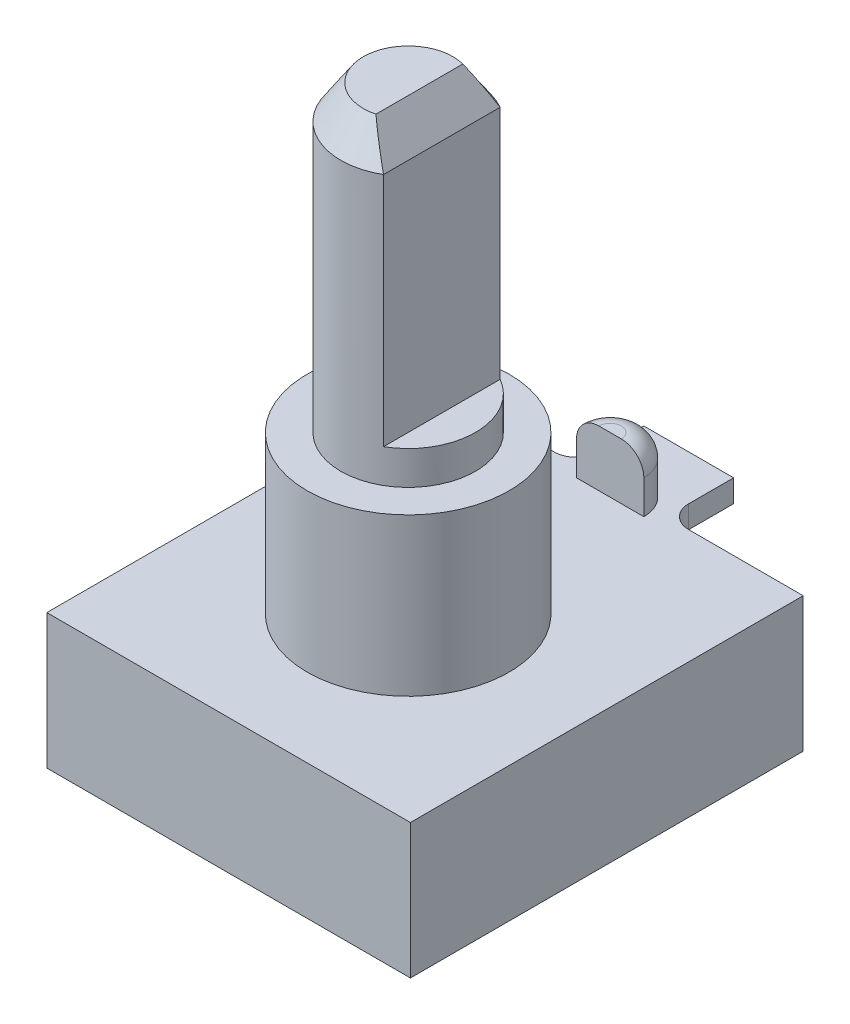
ISO-10303-21;
HEADER;
FILE_DESCRIPTION(('STEP AP214'),'2;1');
FILE_NAME('part.step','',(''),(''),'','','');
FILE_SCHEMA(('AUTOMOTIVE_DESIGN { 1 0 10303 214 1 1 1 1 }'));
ENDSEC;
DATA;
#1=APPLICATION_CONTEXT('core data for automotive mechanical design processes');
#2=APPLICATION_PROTOCOL_DEFINITION('international standard','automotive_design',2000,#1);
#3=PRODUCT_CONTEXT('',#1,'mechanical');
#4=PRODUCT('Part','Part','',(#3));
#5=PRODUCT_RELATED_PRODUCT_CATEGORY('part','',(#4));
#6=PRODUCT_DEFINITION_FORMATION('','',#4);
#7=PRODUCT_DEFINITION_CONTEXT('part definition',#1,'design');
#8=PRODUCT_DEFINITION('design','',#6,#7);
#9=PRODUCT_DEFINITION_SHAPE('','',#8);
#10=(LENGTH_UNIT() NAMED_UNIT(*) SI_UNIT(.MILLI.,.METRE.));
#11=(NAMED_UNIT(*) PLANE_ANGLE_UNIT() SI_UNIT($,.RADIAN.));
#12=(NAMED_UNIT(*) SI_UNIT($,.STERADIAN.) SOLID_ANGLE_UNIT());
#13=UNCERTAINTY_MEASURE_WITH_UNIT(LENGTH_MEASURE(1.E-05),#10,'distance_accuracy_value','');
#14=(GEOMETRIC_REPRESENTATION_CONTEXT(3) GLOBAL_UNCERTAINTY_ASSIGNED_CONTEXT((#13)) GLOBAL_UNIT_ASSIGNED_CONTEXT((#10,
#11,#12)) REPRESENTATION_CONTEXT('',''));
#15=CARTESIAN_POINT('',(0.,0.,0.));
#16=DIRECTION('',(0.,0.,1.));
#17=DIRECTION('',(1.,0.,0.));
#18=AXIS2_PLACEMENT_3D('',#15,#16,#17);
#19=CARTESIAN_POINT('',(0.,6.,0.));
#20=DIRECTION('',(0.,1.,0.));
#21=DIRECTION('',(0.,0.,1.));
#22=AXIS2_PLACEMENT_3D('',#19,#20,#21);
#23=PLANE('',#22);
#24=CARTESIAN_POINT('',(0.,6.,0.750000000000002));
#25=DIRECTION('',(0.,1.,0.));
#26=DIRECTION('',(0.,0.,1.));
#27=AXIS2_PLACEMENT_3D('',#24,#25,#26);
#28=CIRCLE('',#27,4.5);
#29=CARTESIAN_POINT('',(0.,6.,5.25));
#30=VERTEX_POINT('',#29);
#31=EDGE_CURVE('E226',#30,#30,#28,.T.);
#32=ORIENTED_EDGE('',*,*,#31,.F.);
#33=EDGE_LOOP('',(#32));
#34=FACE_BOUND('',#33,.T.);
#35=DIRECTION('',(0.,0.,-1.));
#36=VECTOR('',#35,1.);
#37=CARTESIAN_POINT('',(8.1,6.,-8.75));
#38=LINE('',#37,#36);
#39=CARTESIAN_POINT('',(8.1,6.,8.75));
#40=VERTEX_POINT('',#39);
#41=CARTESIAN_POINT('',(8.1,6.,-8.75));
#42=VERTEX_POINT('',#41);
#43=EDGE_CURVE('E266',#40,#42,#38,.T.);
#44=ORIENTED_EDGE('',*,*,#43,.T.);
#45=DIRECTION('',(-1.,0.,0.));
#46=VECTOR('',#45,1.);
#47=CARTESIAN_POINT('',(-8.1,6.,-8.75));
#48=LINE('',#47,#46);
#49=CARTESIAN_POINT('',(3.,6.,-8.75));
#50=VERTEX_POINT('',#49);
#51=EDGE_CURVE('E271',#42,#50,#48,.T.);
#52=ORIENTED_EDGE('',*,*,#51,.T.);
#53=CARTESIAN_POINT('',(3.,6.,-9.75));
#54=DIRECTION('',(0.,1.,0.));
#55=DIRECTION('',(0.,0.,1.));
#56=AXIS2_PLACEMENT_3D('',#53,#54,#55);
#57=CIRCLE('',#56,1.);
#58=CARTESIAN_POINT('',(2.,6.,-9.75));
#59=VERTEX_POINT('',#58);
#60=EDGE_CURVE('E309',#50,#59,#57,.F.);
#61=ORIENTED_EDGE('',*,*,#60,.T.);
#62=DIRECTION('',(0.,0.,1.));
#63=VECTOR('',#62,1.);
#64=CARTESIAN_POINT('',(2.,6.,-11.75));
#65=LINE('',#64,#63);
#66=CARTESIAN_POINT('',(2.,6.,-11.75));
#67=VERTEX_POINT('',#66);
#68=EDGE_CURVE('E204',#67,#59,#65,.T.);
#69=ORIENTED_EDGE('',*,*,#68,.F.);
#70=DIRECTION('',(1.,0.,0.));
#71=VECTOR('',#70,1.);
#72=CARTESIAN_POINT('',(2.,6.,-11.75));
#73=LINE('',#72,#71);
#74=CARTESIAN_POINT('',(-2.,6.,-11.75));
#75=VERTEX_POINT('',#74);
#76=EDGE_CURVE('E191',#75,#67,#73,.T.);
#77=ORIENTED_EDGE('',*,*,#76,.F.);
#78=DIRECTION('',(0.,0.,1.));
#79=VECTOR('',#78,1.);
#80=CARTESIAN_POINT('',(-2.,6.,-11.75));
#81=LINE('',#80,#79);
#82=CARTESIAN_POINT('',(-2.,6.,-9.75));
#83=VERTEX_POINT('',#82);
#84=EDGE_CURVE('E207',#75,#83,#81,.T.);
#85=ORIENTED_EDGE('',*,*,#84,.T.);
#86=CARTESIAN_POINT('',(-3.,6.,-9.75));
#87=DIRECTION('',(0.,1.,0.));
#88=DIRECTION('',(0.,0.,1.));
#89=AXIS2_PLACEMENT_3D('',#86,#87,#88);
#90=CIRCLE('',#89,1.);
#91=CARTESIAN_POINT('',(-3.,6.,-8.75));
#92=VERTEX_POINT('',#91);
#93=EDGE_CURVE('E311',#83,#92,#90,.F.);
#94=ORIENTED_EDGE('',*,*,#93,.T.);
#95=CARTESIAN_POINT('',(-8.1,6.,-8.75));
#96=VERTEX_POINT('',#95);
#97=EDGE_CURVE('E269',#92,#96,#48,.T.);
#98=ORIENTED_EDGE('',*,*,#97,.T.);
#99=DIRECTION('',(0.,0.,1.));
#100=VECTOR('',#99,1.);
#101=CARTESIAN_POINT('',(-8.1,6.,-8.75));
#102=LINE('',#101,#100);
#103=CARTESIAN_POINT('',(-8.1,6.,8.75));
#104=VERTEX_POINT('',#103);
#105=EDGE_CURVE('E274',#96,#104,#102,.T.);
#106=ORIENTED_EDGE('',*,*,#105,.T.);
#107=DIRECTION('',(1.,0.,0.));
#108=VECTOR('',#107,1.);
#109=CARTESIAN_POINT('',(-8.1,6.,8.75));
#110=LINE('',#109,#108);
#111=EDGE_CURVE('E276',#104,#40,#110,.T.);
#112=ORIENTED_EDGE('',*,*,#111,.T.);
#113=EDGE_LOOP('',(#44,#52,#61,#69,#77,#85,#94,#98,#106,#112));
#114=FACE_BOUND('',#113,.T.);
#115=DIRECTION('',(1.,0.,0.));
#116=VECTOR('',#115,1.);
#117=CARTESIAN_POINT('',(-1.5,6.,-8.25));
#118=LINE('',#117,#116);
#119=CARTESIAN_POINT('',(-1.5,6.,-8.25));
#120=VERTEX_POINT('',#119);
#121=CARTESIAN_POINT('',(1.5,6.,-8.25));
#122=VERTEX_POINT('',#121);
#123=EDGE_CURVE('E179',#120,#122,#118,.T.);
#124=ORIENTED_EDGE('',*,*,#123,.F.);
#125=CARTESIAN_POINT('',(0.,6.,-8.25));
#126=DIRECTION('',(0.,1.,0.));
#127=DIRECTION('',(0.,0.,1.));
#128=AXIS2_PLACEMENT_3D('',#125,#126,#127);
#129=CIRCLE('',#128,1.5);
#130=EDGE_CURVE('E173',#122,#120,#129,.T.);
#131=ORIENTED_EDGE('',*,*,#130,.F.);
#132=EDGE_LOOP('',(#124,#131));
#133=FACE_BOUND('',#132,.T.);
#134=ADVANCED_FACE('F37',(#34,#114,#133),#23,.T.);
#135=CARTESIAN_POINT('',(-8.1,6.,-8.75));
#136=DIRECTION('',(0.,0.,1.));
#137=DIRECTION('',(1.,0.,0.));
#138=AXIS2_PLACEMENT_3D('',#135,#136,#137);
#139=PLANE('',#138);
#140=DIRECTION('',(-1.,0.,0.));
#141=VECTOR('',#140,1.);
#142=CARTESIAN_POINT('',(2.,5.,-8.75));
#143=LINE('',#142,#141);
#144=CARTESIAN_POINT('',(3.,5.,-8.75));
#145=VERTEX_POINT('',#144);
#146=CARTESIAN_POINT('',(-3.,5.,-8.75));
#147=VERTEX_POINT('',#146);
#148=EDGE_CURVE('E187',#145,#147,#143,.T.);
#149=ORIENTED_EDGE('',*,*,#148,.F.);
#150=DIRECTION('',(0.,-1.,0.));
#151=VECTOR('',#150,1.);
#152=CARTESIAN_POINT('',(3.,6.,-8.75));
#153=LINE('',#152,#151);
#154=EDGE_CURVE('E301',#145,#50,#153,.F.);
#155=ORIENTED_EDGE('',*,*,#154,.T.);
#156=ORIENTED_EDGE('',*,*,#51,.F.);
#157=DIRECTION('',(0.,-1.,0.));
#158=VECTOR('',#157,1.);
#159=CARTESIAN_POINT('',(8.1,6.,-8.75));
#160=LINE('',#159,#158);
#161=CARTESIAN_POINT('',(8.1,0.,-8.75));
#162=VERTEX_POINT('',#161);
#163=EDGE_CURVE('E232',#42,#162,#160,.T.);
#164=ORIENTED_EDGE('',*,*,#163,.T.);
#165=DIRECTION('',(-1.,0.,0.));
#166=VECTOR('',#165,1.);
#167=CARTESIAN_POINT('',(-8.1,0.,-8.75));
#168=LINE('',#167,#166);
#169=CARTESIAN_POINT('',(-8.1,0.,-8.75));
#170=VERTEX_POINT('',#169);
#171=EDGE_CURVE('E281',#162,#170,#168,.T.);
#172=ORIENTED_EDGE('',*,*,#171,.T.);
#173=DIRECTION('',(0.,-1.,0.));
#174=VECTOR('',#173,1.);
#175=CARTESIAN_POINT('',(-8.1,6.,-8.75));
#176=LINE('',#175,#174);
#177=EDGE_CURVE('E291',#96,#170,#176,.T.);
#178=ORIENTED_EDGE('',*,*,#177,.F.);
#179=ORIENTED_EDGE('',*,*,#97,.F.);
#180=DIRECTION('',(0.,1.,0.));
#181=VECTOR('',#180,1.);
#182=CARTESIAN_POINT('',(-3.,5.,-8.75));
#183=LINE('',#182,#181);
#184=EDGE_CURVE('E298',#92,#147,#183,.F.);
#185=ORIENTED_EDGE('',*,*,#184,.T.);
#186=EDGE_LOOP('',(#149,#155,#156,#164,#172,#178,#179,#185));
#187=FACE_BOUND('',#186,.T.);
#188=ADVANCED_FACE('F358',(#187),#139,.F.);
#189=CARTESIAN_POINT('',(0.,0.,0.));
#190=DIRECTION('',(0.,1.,0.));
#191=DIRECTION('',(0.,0.,1.));
#192=AXIS2_PLACEMENT_3D('',#189,#190,#191);
#193=PLANE('',#192);
#194=DIRECTION('',(0.,0.,-1.));
#195=VECTOR('',#194,1.);
#196=CARTESIAN_POINT('',(8.1,0.,-8.75));
#197=LINE('',#196,#195);
#198=CARTESIAN_POINT('',(8.1,0.,8.75));
#199=VERTEX_POINT('',#198);
#200=EDGE_CURVE('E265',#199,#162,#197,.T.);
#201=ORIENTED_EDGE('',*,*,#200,.F.);
#202=DIRECTION('',(1.,0.,0.));
#203=VECTOR('',#202,1.);
#204=CARTESIAN_POINT('',(-8.1,0.,8.75));
#205=LINE('',#204,#203);
#206=CARTESIAN_POINT('',(-8.1,0.,8.75));
#207=VERTEX_POINT('',#206);
#208=EDGE_CURVE('E270',#207,#199,#205,.T.);
#209=ORIENTED_EDGE('',*,*,#208,.F.);
#210=DIRECTION('',(0.,0.,1.));
#211=VECTOR('',#210,1.);
#212=CARTESIAN_POINT('',(-8.1,0.,-8.75));
#213=LINE('',#212,#211);
#214=EDGE_CURVE('E283',#170,#207,#213,.T.);
#215=ORIENTED_EDGE('',*,*,#214,.F.);
#216=ORIENTED_EDGE('',*,*,#171,.F.);
#217=EDGE_LOOP('',(#201,#209,#215,#216));
#218=FACE_BOUND('',#217,.T.);
#219=DIRECTION('',(0.,0.,1.));
#220=VECTOR('',#219,1.);
#221=CARTESIAN_POINT('',(6.,0.,-6.));
#222=LINE('',#221,#220);
#223=CARTESIAN_POINT('',(6.,0.,-6.));
#224=VERTEX_POINT('',#223);
#225=CARTESIAN_POINT('',(6.,0.,6.));
#226=VERTEX_POINT('',#225);
#227=EDGE_CURVE('E229',#224,#226,#222,.T.);
#228=ORIENTED_EDGE('',*,*,#227,.F.);
#229=DIRECTION('',(1.,0.,0.));
#230=VECTOR('',#229,1.);
#231=CARTESIAN_POINT('',(-6.,0.,-6.));
#232=LINE('',#231,#230);
#233=CARTESIAN_POINT('',(-6.,0.,-6.));
#234=VERTEX_POINT('',#233);
#235=EDGE_CURVE('E237',#234,#224,#232,.T.);
#236=ORIENTED_EDGE('',*,*,#235,.F.);
#237=DIRECTION('',(0.,0.,-1.));
#238=VECTOR('',#237,1.);
#239=CARTESIAN_POINT('',(-6.,0.,-6.));
#240=LINE('',#239,#238);
#241=CARTESIAN_POINT('',(-6.,0.,6.));
#242=VERTEX_POINT('',#241);
#243=EDGE_CURVE('E249',#242,#234,#240,.T.);
#244=ORIENTED_EDGE('',*,*,#243,.F.);
#245=DIRECTION('',(-1.,0.,0.));
#246=VECTOR('',#245,1.);
#247=CARTESIAN_POINT('',(-6.,0.,6.));
#248=LINE('',#247,#246);
#249=EDGE_CURVE('E246',#226,#242,#248,.T.);
#250=ORIENTED_EDGE('',*,*,#249,.F.);
#251=EDGE_LOOP('',(#228,#236,#244,#250));
#252=FACE_BOUND('',#251,.T.);
#253=ADVANCED_FACE('F364',(#218,#252),#193,.F.);
#254=CARTESIAN_POINT('',(8.1,6.,-8.75));
#255=DIRECTION('',(-1.,0.,0.));
#256=DIRECTION('',(0.,0.,1.));
#257=AXIS2_PLACEMENT_3D('',#254,#255,#256);
#258=PLANE('',#257);
#259=ORIENTED_EDGE('',*,*,#200,.T.);
#260=ORIENTED_EDGE('',*,*,#163,.F.);
#261=ORIENTED_EDGE('',*,*,#43,.F.);
#262=DIRECTION('',(0.,-1.,0.));
#263=VECTOR('',#262,1.);
#264=CARTESIAN_POINT('',(8.1,6.,8.75));
#265=LINE('',#264,#263);
#266=EDGE_CURVE('E278',#40,#199,#265,.T.);
#267=ORIENTED_EDGE('',*,*,#266,.T.);
#268=EDGE_LOOP('',(#259,#260,#261,#267));
#269=FACE_BOUND('',#268,.T.);
#270=ADVANCED_FACE('F375',(#269),#258,.F.);
#271=CARTESIAN_POINT('',(-8.1,6.,-8.75));
#272=DIRECTION('',(1.,0.,0.));
#273=DIRECTION('',(0.,0.,-1.));
#274=AXIS2_PLACEMENT_3D('',#271,#272,#273);
#275=PLANE('',#274);
#276=ORIENTED_EDGE('',*,*,#214,.T.);
#277=DIRECTION('',(0.,-1.,0.));
#278=VECTOR('',#277,1.);
#279=CARTESIAN_POINT('',(-8.1,6.,8.75));
#280=LINE('',#279,#278);
#281=EDGE_CURVE('E288',#104,#207,#280,.T.);
#282=ORIENTED_EDGE('',*,*,#281,.F.);
#283=ORIENTED_EDGE('',*,*,#105,.F.);
#284=ORIENTED_EDGE('',*,*,#177,.T.);
#285=EDGE_LOOP('',(#276,#282,#283,#284));
#286=FACE_BOUND('',#285,.T.);
#287=ADVANCED_FACE('F380',(#286),#275,.F.);
#288=CARTESIAN_POINT('',(-8.1,6.,8.75));
#289=DIRECTION('',(0.,0.,-1.));
#290=DIRECTION('',(-1.,0.,0.));
#291=AXIS2_PLACEMENT_3D('',#288,#289,#290);
#292=PLANE('',#291);
#293=ORIENTED_EDGE('',*,*,#208,.T.);
#294=ORIENTED_EDGE('',*,*,#266,.F.);
#295=ORIENTED_EDGE('',*,*,#111,.F.);
#296=ORIENTED_EDGE('',*,*,#281,.T.);
#297=EDGE_LOOP('',(#293,#294,#295,#296));
#298=FACE_BOUND('',#297,.T.);
#299=ADVANCED_FACE('F377',(#298),#292,.F.);
#300=CARTESIAN_POINT('',(6.,-1.5,-6.));
#301=DIRECTION('',(-1.,0.,0.));
#302=DIRECTION('',(0.,0.,1.));
#303=AXIS2_PLACEMENT_3D('',#300,#301,#302);
#304=PLANE('',#303);
#305=ORIENTED_EDGE('',*,*,#227,.T.);
#306=DIRECTION('',(0.,1.,0.));
#307=VECTOR('',#306,1.);
#308=CARTESIAN_POINT('',(6.,-1.5,6.));
#309=LINE('',#308,#307);
#310=CARTESIAN_POINT('',(6.,-1.5,6.));
#311=VERTEX_POINT('',#310);
#312=EDGE_CURVE('E262',#311,#226,#309,.T.);
#313=ORIENTED_EDGE('',*,*,#312,.F.);
#314=DIRECTION('',(0.,0.,1.));
#315=VECTOR('',#314,1.);
#316=CARTESIAN_POINT('',(6.,-1.5,-6.));
#317=LINE('',#316,#315);
#318=CARTESIAN_POINT('',(6.,-1.5,-6.));
#319=VERTEX_POINT('',#318);
#320=EDGE_CURVE('E233',#319,#311,#317,.T.);
#321=ORIENTED_EDGE('',*,*,#320,.F.);
#322=DIRECTION('',(0.,1.,0.));
#323=VECTOR('',#322,1.);
#324=CARTESIAN_POINT('',(6.,-1.5,-6.));
#325=LINE('',#324,#323);
#326=EDGE_CURVE('E243',#319,#224,#325,.T.);
#327=ORIENTED_EDGE('',*,*,#326,.T.);
#328=EDGE_LOOP('',(#305,#313,#321,#327));
#329=FACE_BOUND('',#328,.T.);
#330=ADVANCED_FACE('F371',(#329),#304,.F.);
#331=CARTESIAN_POINT('',(-6.,-1.5,6.));
#332=DIRECTION('',(0.,0.,-1.));
#333=DIRECTION('',(-1.,0.,0.));
#334=AXIS2_PLACEMENT_3D('',#331,#332,#333);
#335=PLANE('',#334);
#336=ORIENTED_EDGE('',*,*,#249,.T.);
#337=DIRECTION('',(0.,1.,0.));
#338=VECTOR('',#337,1.);
#339=CARTESIAN_POINT('',(-6.,-1.5,6.));
#340=LINE('',#339,#338);
#341=CARTESIAN_POINT('',(-6.,-1.5,6.));
#342=VERTEX_POINT('',#341);
#343=EDGE_CURVE('E259',#342,#242,#340,.T.);
#344=ORIENTED_EDGE('',*,*,#343,.F.);
#345=DIRECTION('',(-1.,0.,0.));
#346=VECTOR('',#345,1.);
#347=CARTESIAN_POINT('',(-6.,-1.5,6.));
#348=LINE('',#347,#346);
#349=EDGE_CURVE('E236',#311,#342,#348,.T.);
#350=ORIENTED_EDGE('',*,*,#349,.F.);
#351=ORIENTED_EDGE('',*,*,#312,.T.);
#352=EDGE_LOOP('',(#336,#344,#350,#351));
#353=FACE_BOUND('',#352,.T.);
#354=ADVANCED_FACE('F443',(#353),#335,.F.);
#355=CARTESIAN_POINT('',(-6.,-1.5,-6.));
#356=DIRECTION('',(1.,0.,0.));
#357=DIRECTION('',(0.,0.,-1.));
#358=AXIS2_PLACEMENT_3D('',#355,#356,#357);
#359=PLANE('',#358);
#360=ORIENTED_EDGE('',*,*,#243,.T.);
#361=DIRECTION('',(0.,1.,0.));
#362=VECTOR('',#361,1.);
#363=CARTESIAN_POINT('',(-6.,-1.5,-6.));
#364=LINE('',#363,#362);
#365=CARTESIAN_POINT('',(-6.,-1.5,-6.));
#366=VERTEX_POINT('',#365);
#367=EDGE_CURVE('E256',#366,#234,#364,.T.);
#368=ORIENTED_EDGE('',*,*,#367,.F.);
#369=DIRECTION('',(0.,0.,-1.));
#370=VECTOR('',#369,1.);
#371=CARTESIAN_POINT('',(-6.,-1.5,-6.));
#372=LINE('',#371,#370);
#373=EDGE_CURVE('E239',#342,#366,#372,.T.);
#374=ORIENTED_EDGE('',*,*,#373,.F.);
#375=ORIENTED_EDGE('',*,*,#343,.T.);
#376=EDGE_LOOP('',(#360,#368,#374,#375));
#377=FACE_BOUND('',#376,.T.);
#378=ADVANCED_FACE('F441',(#377),#359,.F.);
#379=CARTESIAN_POINT('',(-6.,-1.5,-6.));
#380=DIRECTION('',(0.,0.,1.));
#381=DIRECTION('',(1.,0.,0.));
#382=AXIS2_PLACEMENT_3D('',#379,#380,#381);
#383=PLANE('',#382);
#384=ORIENTED_EDGE('',*,*,#235,.T.);
#385=ORIENTED_EDGE('',*,*,#326,.F.);
#386=DIRECTION('',(1.,0.,0.));
#387=VECTOR('',#386,1.);
#388=CARTESIAN_POINT('',(-6.,-1.5,-6.));
#389=LINE('',#388,#387);
#390=EDGE_CURVE('E241',#366,#319,#389,.T.);
#391=ORIENTED_EDGE('',*,*,#390,.F.);
#392=ORIENTED_EDGE('',*,*,#367,.T.);
#393=EDGE_LOOP('',(#384,#385,#391,#392));
#394=FACE_BOUND('',#393,.T.);
#395=ADVANCED_FACE('F432',(#394),#383,.F.);
#396=CARTESIAN_POINT('',(0.,-1.5,0.));
#397=DIRECTION('',(0.,1.,0.));
#398=DIRECTION('',(0.,0.,1.));
#399=AXIS2_PLACEMENT_3D('',#396,#397,#398);
#400=PLANE('',#399);
#401=ORIENTED_EDGE('',*,*,#320,.T.);
#402=ORIENTED_EDGE('',*,*,#349,.T.);
#403=ORIENTED_EDGE('',*,*,#373,.T.);
#404=ORIENTED_EDGE('',*,*,#390,.T.);
#405=EDGE_LOOP('',(#401,#402,#403,#404));
#406=FACE_BOUND('',#405,.T.);
#407=ADVANCED_FACE('F437',(#406),#400,.F.);
#408=CARTESIAN_POINT('',(0.,13.,0.750000000000002));
#409=DIRECTION('',(0.,-1.,0.));
#410=DIRECTION('',(0.,0.,-1.));
#411=AXIS2_PLACEMENT_3D('',#408,#409,#410);
#412=CYLINDRICAL_SURFACE('',#411,4.5);
#413=CARTESIAN_POINT('',(0.,13.,0.750000000000002));
#414=DIRECTION('',(0.,1.,0.));
#415=DIRECTION('',(0.,0.,1.));
#416=AXIS2_PLACEMENT_3D('',#413,#414,#415);
#417=CIRCLE('',#416,4.5);
#418=CARTESIAN_POINT('',(0.,13.,5.25));
#419=VERTEX_POINT('',#418);
#420=EDGE_CURVE('E219',#419,#419,#417,.T.);
#421=ORIENTED_EDGE('',*,*,#420,.F.);
#422=EDGE_LOOP('',(#421));
#423=FACE_BOUND('',#422,.T.);
#424=ORIENTED_EDGE('',*,*,#31,.T.);
#425=EDGE_LOOP('',(#424));
#426=FACE_BOUND('',#425,.T.);
#427=ADVANCED_FACE('F455',(#423,#426),#412,.T.);
#428=CARTESIAN_POINT('',(0.,13.,0.750000000000002));
#429=DIRECTION('',(0.,1.,0.));
#430=DIRECTION('',(0.,0.,1.));
#431=AXIS2_PLACEMENT_3D('',#428,#429,#430);
#432=PLANE('',#431);
#433=CARTESIAN_POINT('',(0.,13.,0.750000000000002));
#434=DIRECTION('',(0.,1.,0.));
#435=DIRECTION('',(0.,0.,1.));
#436=AXIS2_PLACEMENT_3D('',#433,#434,#435);
#437=CIRCLE('',#436,3.);
#438=CARTESIAN_POINT('',(0.,13.,3.75));
#439=VERTEX_POINT('',#438);
#440=EDGE_CURVE('E222',#439,#439,#437,.T.);
#441=ORIENTED_EDGE('',*,*,#440,.F.);
#442=EDGE_LOOP('',(#441));
#443=FACE_BOUND('',#442,.T.);
#444=ORIENTED_EDGE('',*,*,#420,.T.);
#445=EDGE_LOOP('',(#444));
#446=FACE_BOUND('',#445,.T.);
#447=ADVANCED_FACE('F458',(#443,#446),#432,.T.);
#448=CARTESIAN_POINT('',(0.,26.5,0.750000000000002));
#449=DIRECTION('',(0.,-1.,0.));
#450=DIRECTION('',(0.,0.,-1.));
#451=AXIS2_PLACEMENT_3D('',#448,#449,#450);
#452=CYLINDRICAL_SURFACE('',#451,3.);
#453=DIRECTION('',(0.,1.,0.));
#454=VECTOR('',#453,1.);
#455=CARTESIAN_POINT('',(1.5,14.5,3.34807621135332));
#456=LINE('',#455,#454);
#457=CARTESIAN_POINT('',(1.5,14.5,3.34807621135332));
#458=VERTEX_POINT('',#457);
#459=CARTESIAN_POINT('',(1.5,25.,3.34807621135332));
#460=VERTEX_POINT('',#459);
#461=EDGE_CURVE('E216',#458,#460,#456,.T.);
#462=ORIENTED_EDGE('',*,*,#461,.T.);
#463=CARTESIAN_POINT('',(0.,25.,0.750000000000002));
#464=DIRECTION('',(0.,1.,0.));
#465=DIRECTION('',(0.,0.,1.));
#466=AXIS2_PLACEMENT_3D('',#463,#464,#465);
#467=CIRCLE('',#466,3.);
#468=CARTESIAN_POINT('',(1.5,25.,-1.84807621135331));
#469=VERTEX_POINT('',#468);
#470=EDGE_CURVE('E318',#460,#469,#467,.F.);
#471=ORIENTED_EDGE('',*,*,#470,.T.);
#472=DIRECTION('',(0.,1.,0.));
#473=VECTOR('',#472,1.);
#474=CARTESIAN_POINT('',(1.5,14.5,-1.84807621135331));
#475=LINE('',#474,#473);
#476=CARTESIAN_POINT('',(1.5,14.5,-1.84807621135331));
#477=VERTEX_POINT('',#476);
#478=EDGE_CURVE('E215',#477,#469,#475,.T.);
#479=ORIENTED_EDGE('',*,*,#478,.F.);
#480=CARTESIAN_POINT('',(0.,14.5,0.750000000000002));
#481=DIRECTION('',(0.,1.,0.));
#482=DIRECTION('',(0.,0.,1.));
#483=AXIS2_PLACEMENT_3D('',#480,#481,#482);
#484=CIRCLE('',#483,3.);
#485=EDGE_CURVE('E210',#458,#477,#484,.T.);
#486=ORIENTED_EDGE('',*,*,#485,.F.);
#487=EDGE_LOOP('',(#462,#471,#479,#486));
#488=FACE_BOUND('',#487,.T.);
#489=ORIENTED_EDGE('',*,*,#440,.T.);
#490=EDGE_LOOP('',(#489));
#491=FACE_BOUND('',#490,.T.);
#492=ADVANCED_FACE('F462',(#488,#491),#452,.T.);
#493=CARTESIAN_POINT('',(0.,26.5,0.750000000000002));
#494=DIRECTION('',(0.,1.,0.));
#495=DIRECTION('',(0.,0.,1.));
#496=AXIS2_PLACEMENT_3D('',#493,#494,#495);
#497=PLANE('',#496);
#498=CARTESIAN_POINT('',(0.,26.5,0.750000000000002));
#499=DIRECTION('',(0.,1.,0.));
#500=DIRECTION('',(0.,0.,1.));
#501=AXIS2_PLACEMENT_3D('',#498,#499,#500);
#502=CIRCLE('',#501,2.00000000000001);
#503=CARTESIAN_POINT('',(0.499999999999995,26.5,-1.18649167310372));
#504=VERTEX_POINT('',#503);
#505=CARTESIAN_POINT('',(0.499999999999996,26.5,2.68649167310372));
#506=VERTEX_POINT('',#505);
#507=EDGE_CURVE('E315',#504,#506,#502,.T.);
#508=ORIENTED_EDGE('',*,*,#507,.T.);
#509=DIRECTION('',(0.,0.,-1.));
#510=VECTOR('',#509,1.);
#511=CARTESIAN_POINT('',(0.499999999999995,26.5,-0.572875655532306));
#512=LINE('',#511,#510);
#513=EDGE_CURVE('E501',#506,#504,#512,.T.);
#514=ORIENTED_EDGE('',*,*,#513,.T.);
#515=EDGE_LOOP('',(#508,#514));
#516=FACE_BOUND('',#515,.T.);
#517=ADVANCED_FACE('F466',(#516),#497,.T.);
#518=CARTESIAN_POINT('',(1.5,14.5,0.));
#519=DIRECTION('',(-1.,0.,0.));
#520=DIRECTION('',(0.,0.,1.));
#521=AXIS2_PLACEMENT_3D('',#518,#519,#520);
#522=PLANE('',#521);
#523=ORIENTED_EDGE('',*,*,#478,.T.);
#524=DIRECTION('',(0.,0.,1.));
#525=VECTOR('',#524,1.);
#526=CARTESIAN_POINT('',(1.5,25.,2.07287565553231));
#527=LINE('',#526,#525);
#528=EDGE_CURVE('E321',#469,#460,#527,.T.);
#529=ORIENTED_EDGE('',*,*,#528,.T.);
#530=ORIENTED_EDGE('',*,*,#461,.F.);
#531=DIRECTION('',(0.,0.,1.));
#532=VECTOR('',#531,1.);
#533=CARTESIAN_POINT('',(1.5,14.5,0.));
#534=LINE('',#533,#532);
#535=EDGE_CURVE('E212',#477,#458,#534,.T.);
#536=ORIENTED_EDGE('',*,*,#535,.F.);
#537=EDGE_LOOP('',(#523,#529,#530,#536));
#538=FACE_BOUND('',#537,.T.);
#539=ADVANCED_FACE('F470',(#538),#522,.F.);
#540=CARTESIAN_POINT('',(0.,14.5,0.));
#541=DIRECTION('',(0.,1.,0.));
#542=DIRECTION('',(0.,0.,1.));
#543=AXIS2_PLACEMENT_3D('',#540,#541,#542);
#544=PLANE('',#543);
#545=ORIENTED_EDGE('',*,*,#485,.T.);
#546=ORIENTED_EDGE('',*,*,#535,.T.);
#547=EDGE_LOOP('',(#545,#546));
#548=FACE_BOUND('',#547,.T.);
#549=ADVANCED_FACE('F474',(#548),#544,.T.);
#550=CARTESIAN_POINT('',(-2.,5.,-11.75));
#551=DIRECTION('',(1.,0.,0.));
#552=DIRECTION('',(0.,0.,-1.));
#553=AXIS2_PLACEMENT_3D('',#550,#551,#552);
#554=PLANE('',#553);
#555=DIRECTION('',(0.,0.,1.));
#556=VECTOR('',#555,1.);
#557=CARTESIAN_POINT('',(-2.,5.,-11.75));
#558=LINE('',#557,#556);
#559=CARTESIAN_POINT('',(-2.,5.,-11.75));
#560=VERTEX_POINT('',#559);
#561=CARTESIAN_POINT('',(-2.,5.,-9.75));
#562=VERTEX_POINT('',#561);
#563=EDGE_CURVE('E197',#560,#562,#558,.T.);
#564=ORIENTED_EDGE('',*,*,#563,.T.);
#565=DIRECTION('',(0.,1.,0.));
#566=VECTOR('',#565,1.);
#567=CARTESIAN_POINT('',(-2.,6.,-9.75));
#568=LINE('',#567,#566);
#569=EDGE_CURVE('E303',#562,#83,#568,.T.);
#570=ORIENTED_EDGE('',*,*,#569,.T.);
#571=ORIENTED_EDGE('',*,*,#84,.F.);
#572=DIRECTION('',(0.,1.,0.));
#573=VECTOR('',#572,1.);
#574=CARTESIAN_POINT('',(-2.,5.,-11.75));
#575=LINE('',#574,#573);
#576=EDGE_CURVE('E188',#560,#75,#575,.T.);
#577=ORIENTED_EDGE('',*,*,#576,.F.);
#578=EDGE_LOOP('',(#564,#570,#571,#577));
#579=FACE_BOUND('',#578,.T.);
#580=ADVANCED_FACE('F405',(#579),#554,.F.);
#581=CARTESIAN_POINT('',(2.,5.,-11.75));
#582=DIRECTION('',(-1.,0.,0.));
#583=DIRECTION('',(0.,0.,1.));
#584=AXIS2_PLACEMENT_3D('',#581,#582,#583);
#585=PLANE('',#584);
#586=ORIENTED_EDGE('',*,*,#68,.T.);
#587=DIRECTION('',(0.,-1.,0.));
#588=VECTOR('',#587,1.);
#589=CARTESIAN_POINT('',(2.,5.,-9.75));
#590=LINE('',#589,#588);
#591=CARTESIAN_POINT('',(2.,5.,-9.75));
#592=VERTEX_POINT('',#591);
#593=EDGE_CURVE('E225',#59,#592,#590,.T.);
#594=ORIENTED_EDGE('',*,*,#593,.T.);
#595=DIRECTION('',(0.,0.,1.));
#596=VECTOR('',#595,1.);
#597=CARTESIAN_POINT('',(2.,5.,-11.75));
#598=LINE('',#597,#596);
#599=CARTESIAN_POINT('',(2.,5.,-11.75));
#600=VERTEX_POINT('',#599);
#601=EDGE_CURVE('E201',#600,#592,#598,.T.);
#602=ORIENTED_EDGE('',*,*,#601,.F.);
#603=DIRECTION('',(0.,-1.,0.));
#604=VECTOR('',#603,1.);
#605=CARTESIAN_POINT('',(2.,5.,-11.75));
#606=LINE('',#605,#604);
#607=EDGE_CURVE('E193',#67,#600,#606,.T.);
#608=ORIENTED_EDGE('',*,*,#607,.F.);
#609=EDGE_LOOP('',(#586,#594,#602,#608));
#610=FACE_BOUND('',#609,.T.);
#611=ADVANCED_FACE('F413',(#610),#585,.F.);
#612=CARTESIAN_POINT('',(2.,5.,-11.75));
#613=DIRECTION('',(0.,1.,0.));
#614=DIRECTION('',(0.,0.,1.));
#615=AXIS2_PLACEMENT_3D('',#612,#613,#614);
#616=PLANE('',#615);
#617=ORIENTED_EDGE('',*,*,#148,.T.);
#618=CARTESIAN_POINT('',(-3.,5.,-9.75));
#619=DIRECTION('',(0.,1.,0.));
#620=DIRECTION('',(0.,0.,1.));
#621=AXIS2_PLACEMENT_3D('',#618,#619,#620);
#622=CIRCLE('',#621,1.);
#623=EDGE_CURVE('E313',#147,#562,#622,.T.);
#624=ORIENTED_EDGE('',*,*,#623,.T.);
#625=ORIENTED_EDGE('',*,*,#563,.F.);
#626=DIRECTION('',(-1.,0.,0.));
#627=VECTOR('',#626,1.);
#628=CARTESIAN_POINT('',(2.,5.,-11.75));
#629=LINE('',#628,#627);
#630=EDGE_CURVE('E195',#600,#560,#629,.T.);
#631=ORIENTED_EDGE('',*,*,#630,.F.);
#632=ORIENTED_EDGE('',*,*,#601,.T.);
#633=CARTESIAN_POINT('',(3.,5.,-9.75));
#634=DIRECTION('',(0.,1.,0.));
#635=DIRECTION('',(0.,0.,1.));
#636=AXIS2_PLACEMENT_3D('',#633,#634,#635);
#637=CIRCLE('',#636,1.);
#638=EDGE_CURVE('E306',#592,#145,#637,.T.);
#639=ORIENTED_EDGE('',*,*,#638,.T.);
#640=EDGE_LOOP('',(#617,#624,#625,#631,#632,#639));
#641=FACE_BOUND('',#640,.T.);
#642=ADVANCED_FACE('F401',(#641),#616,.F.);
#643=CARTESIAN_POINT('',(0.,0.,-11.75));
#644=DIRECTION('',(0.,0.,1.));
#645=DIRECTION('',(1.,0.,0.));
#646=AXIS2_PLACEMENT_3D('',#643,#644,#645);
#647=PLANE('',#646);
#648=ORIENTED_EDGE('',*,*,#576,.T.);
#649=ORIENTED_EDGE('',*,*,#76,.T.);
#650=ORIENTED_EDGE('',*,*,#607,.T.);
#651=ORIENTED_EDGE('',*,*,#630,.T.);
#652=EDGE_LOOP('',(#648,#649,#650,#651));
#653=FACE_BOUND('',#652,.T.);
#654=ADVANCED_FACE('F390',(#653),#647,.F.);
#655=CARTESIAN_POINT('',(3.,5.,-9.75));
#656=DIRECTION('',(0.,1.,0.));
#657=DIRECTION('',(0.,0.,1.));
#658=AXIS2_PLACEMENT_3D('',#655,#656,#657);
#659=CYLINDRICAL_SURFACE('',#658,1.);
#660=ORIENTED_EDGE('',*,*,#60,.F.);
#661=ORIENTED_EDGE('',*,*,#154,.F.);
#662=ORIENTED_EDGE('',*,*,#638,.F.);
#663=ORIENTED_EDGE('',*,*,#593,.F.);
#664=EDGE_LOOP('',(#660,#661,#662,#663));
#665=FACE_BOUND('',#664,.T.);
#666=ADVANCED_FACE('F388',(#665),#659,.F.);
#667=CARTESIAN_POINT('',(-3.,5.,-9.75));
#668=DIRECTION('',(0.,-1.,0.));
#669=DIRECTION('',(0.,0.,-1.));
#670=AXIS2_PLACEMENT_3D('',#667,#668,#669);
#671=CYLINDRICAL_SURFACE('',#670,1.);
#672=ORIENTED_EDGE('',*,*,#623,.F.);
#673=ORIENTED_EDGE('',*,*,#184,.F.);
#674=ORIENTED_EDGE('',*,*,#93,.F.);
#675=ORIENTED_EDGE('',*,*,#569,.F.);
#676=EDGE_LOOP('',(#672,#673,#674,#675));
#677=FACE_BOUND('',#676,.T.);
#678=ADVANCED_FACE('F354',(#677),#671,.F.);
#679=CARTESIAN_POINT('',(0.,26.5,0.750000000000002));
#680=DIRECTION('',(0.,-1.,0.));
#681=DIRECTION('',(0.,0.,-1.));
#682=AXIS2_PLACEMENT_3D('',#679,#680,#681);
#683=CONICAL_SURFACE('',#682,2.00000000000001,0.588002603547566);
#684=ORIENTED_EDGE('',*,*,#470,.F.);
#685=CARTESIAN_POINT('',(1.5,25.,3.34807621135332));
#686=CARTESIAN_POINT('',(1.41542648451029,25.1268602732346,3.29922139832864));
#687=CARTESIAN_POINT('',(1.33106150837568,25.2534077374365,3.24916054521452));
#688=CARTESIAN_POINT('',(1.16293129263166,25.5056030610525,3.1461389111097));
#689=CARTESIAN_POINT('',(1.07916574693361,25.6312513795996,3.09317975045331));
#690=CARTESIAN_POINT('',(0.912300165830558,25.8815497512542,2.98380566308033));
#691=CARTESIAN_POINT('',(0.829200319994854,26.0061995200077,2.92738978897762));
#692=CARTESIAN_POINT('',(0.705211186559077,26.1921832201614,2.83961457105492));
#693=CARTESIAN_POINT('',(0.663980110652041,26.2540298340219,2.80982213282435));
#694=CARTESIAN_POINT('',(0.581781962526209,26.3773270562107,2.74906594633837));
#695=CARTESIAN_POINT('',(0.540814904765894,26.4387776428512,2.7181021345621));
#696=CARTESIAN_POINT('',(0.499999999999995,26.5,2.68649167310372));
#697=B_SPLINE_CURVE_WITH_KNOTS('',3,(#685,#686,#687,#688,#689,#690,#691,#692,#693,#694,#695,
#696),.UNSPECIFIED.,.F.,.F.,(4,2,2,2,2,4),(0.,0.480318494110863,0.96037115022311,
1.44055596868466,1.68078316077009,1.92102339854302),.UNSPECIFIED.);
#698=EDGE_CURVE('E331',#460,#506,#697,.T.);
#699=ORIENTED_EDGE('',*,*,#698,.T.);
#700=ORIENTED_EDGE('',*,*,#507,.F.);
#701=CARTESIAN_POINT('',(0.499999999999995,26.5,-1.18649167310372));
#702=CARTESIAN_POINT('',(0.540814904765894,26.4387776428512,-1.2181021345621));
#703=CARTESIAN_POINT('',(0.581781962526209,26.3773270562107,-1.24906594633837));
#704=CARTESIAN_POINT('',(0.66398011065204,26.2540298340219,-1.30982213282434));
#705=CARTESIAN_POINT('',(0.705211186559077,26.1921832201614,-1.33961457105492));
#706=CARTESIAN_POINT('',(0.829200319994854,26.0061995200077,-1.42738978897761));
#707=CARTESIAN_POINT('',(0.912300165830557,25.8815497512542,-1.48380566308033));
#708=CARTESIAN_POINT('',(1.07916574693361,25.6312513795996,-1.59317975045331));
#709=CARTESIAN_POINT('',(1.16293129263166,25.5056030610525,-1.6461389111097));
#710=CARTESIAN_POINT('',(1.33106150837568,25.2534077374365,-1.74916054521452));
#711=CARTESIAN_POINT('',(1.41542648451029,25.1268602732346,-1.79922139832864));
#712=CARTESIAN_POINT('',(1.5,25.,-1.84807621135332));
#713=B_SPLINE_CURVE_WITH_KNOTS('',3,(#701,#702,#703,#704,#705,#706,#707,#708,#709,#710,#711,
#712),.UNSPECIFIED.,.F.,.F.,(4,2,2,2,2,4),(0.,0.240240237772927,0.480467429858361,
0.960652248319912,1.44070490443216,1.92102339854302),.UNSPECIFIED.);
#714=EDGE_CURVE('E324',#504,#469,#713,.T.);
#715=ORIENTED_EDGE('',*,*,#714,.T.);
#716=EDGE_LOOP('',(#684,#699,#700,#715));
#717=FACE_BOUND('',#716,.T.);
#718=ADVANCED_FACE('F338',(#717),#683,.T.);
#719=CARTESIAN_POINT('',(1.5,25.,0.));
#720=DIRECTION('',(0.832050294337844,0.554700196225229,0.));
#721=DIRECTION('',(0.,0.,-1.));
#722=AXIS2_PLACEMENT_3D('',#719,#720,#721);
#723=PLANE('',#722);
#724=ORIENTED_EDGE('',*,*,#714,.F.);
#725=ORIENTED_EDGE('',*,*,#513,.F.);
#726=ORIENTED_EDGE('',*,*,#698,.F.);
#727=ORIENTED_EDGE('',*,*,#528,.F.);
#728=EDGE_LOOP('',(#724,#725,#726,#727));
#729=FACE_BOUND('',#728,.T.);
#730=ADVANCED_FACE('F342',(#729),#723,.T.);
#731=CARTESIAN_POINT('',(0.,8.5,-8.25));
#732=DIRECTION('',(0.,-1.,0.));
#733=DIRECTION('',(0.,0.,-1.));
#734=AXIS2_PLACEMENT_3D('',#731,#732,#733);
#735=CYLINDRICAL_SURFACE('',#734,1.5);
#736=DIRECTION('',(0.,-1.,0.));
#737=VECTOR('',#736,1.);
#738=CARTESIAN_POINT('',(-1.5,8.5,-8.25));
#739=LINE('',#738,#737);
#740=CARTESIAN_POINT('',(-1.5,7.5,-8.25));
#741=VERTEX_POINT('',#740);
#742=EDGE_CURVE('E176',#741,#120,#739,.T.);
#743=ORIENTED_EDGE('',*,*,#742,.F.);
#744=CARTESIAN_POINT('',(0.,7.5,-8.25));
#745=DIRECTION('',(0.,1.,0.));
#746=DIRECTION('',(0.,0.,1.));
#747=AXIS2_PLACEMENT_3D('',#744,#745,#746);
#748=CIRCLE('',#747,1.5);
#749=CARTESIAN_POINT('',(1.5,7.5,-8.25));
#750=VERTEX_POINT('',#749);
#751=EDGE_CURVE('E11',#741,#750,#748,.F.);
#752=ORIENTED_EDGE('',*,*,#751,.T.);
#753=DIRECTION('',(0.,-1.,0.));
#754=VECTOR('',#753,1.);
#755=CARTESIAN_POINT('',(1.5,8.5,-8.25));
#756=LINE('',#755,#754);
#757=EDGE_CURVE('E169',#750,#122,#756,.T.);
#758=ORIENTED_EDGE('',*,*,#757,.T.);
#759=ORIENTED_EDGE('',*,*,#130,.T.);
#760=EDGE_LOOP('',(#743,#752,#758,#759));
#761=FACE_BOUND('',#760,.T.);
#762=ADVANCED_FACE('F171',(#761),#735,.T.);
#763=CARTESIAN_POINT('',(-1.5,8.5,-8.25));
#764=DIRECTION('',(0.,0.,-1.));
#765=DIRECTION('',(-1.,0.,0.));
#766=AXIS2_PLACEMENT_3D('',#763,#764,#765);
#767=PLANE('',#766);
#768=DIRECTION('',(1.,0.,0.));
#769=VECTOR('',#768,1.);
#770=CARTESIAN_POINT('',(-1.5,8.5,-8.25));
#771=LINE('',#770,#769);
#772=CARTESIAN_POINT('',(-0.5,8.5,-8.25));
#773=VERTEX_POINT('',#772);
#774=CARTESIAN_POINT('',(0.5,8.5,-8.25));
#775=VERTEX_POINT('',#774);
#776=EDGE_CURVE('E177',#773,#775,#771,.T.);
#777=ORIENTED_EDGE('',*,*,#776,.F.);
#778=CARTESIAN_POINT('',(-0.5,7.5,-8.25));
#779=DIRECTION('',(0.,0.,-1.));
#780=DIRECTION('',(-1.,0.,0.));
#781=AXIS2_PLACEMENT_3D('',#778,#779,#780);
#782=CIRCLE('',#781,1.);
#783=EDGE_CURVE('E45',#773,#741,#782,.F.);
#784=ORIENTED_EDGE('',*,*,#783,.T.);
#785=ORIENTED_EDGE('',*,*,#742,.T.);
#786=ORIENTED_EDGE('',*,*,#123,.T.);
#787=ORIENTED_EDGE('',*,*,#757,.F.);
#788=CARTESIAN_POINT('',(0.5,7.5,-8.25));
#789=DIRECTION('',(0.,0.,-1.));
#790=DIRECTION('',(-1.,0.,0.));
#791=AXIS2_PLACEMENT_3D('',#788,#789,#790);
#792=CIRCLE('',#791,1.);
#793=EDGE_CURVE('E500',#750,#775,#792,.F.);
#794=ORIENTED_EDGE('',*,*,#793,.T.);
#795=EDGE_LOOP('',(#777,#784,#785,#786,#787,#794));
#796=FACE_BOUND('',#795,.T.);
#797=ADVANCED_FACE('F180',(#796),#767,.F.);
#798=CARTESIAN_POINT('',(0.,8.5,-8.25));
#799=DIRECTION('',(0.,1.,0.));
#800=DIRECTION('',(0.,0.,1.));
#801=AXIS2_PLACEMENT_3D('',#798,#799,#800);
#802=PLANE('',#801);
#803=ORIENTED_EDGE('',*,*,#776,.T.);
#804=CARTESIAN_POINT('',(0.,8.5,-8.25));
#805=DIRECTION('',(0.,1.,0.));
#806=DIRECTION('',(0.,0.,1.));
#807=AXIS2_PLACEMENT_3D('',#804,#805,#806);
#808=CIRCLE('',#807,0.5);
#809=EDGE_CURVE('E499',#775,#773,#808,.T.);
#810=ORIENTED_EDGE('',*,*,#809,.T.);
#811=EDGE_LOOP('',(#803,#810));
#812=FACE_BOUND('',#811,.T.);
#813=ADVANCED_FACE('F489',(#812),#802,.T.);
#814=CARTESIAN_POINT('',(0.,7.5,-8.25));
#815=DIRECTION('',(0.,1.,0.));
#816=DIRECTION('',(0.,0.,1.));
#817=AXIS2_PLACEMENT_3D('',#814,#815,#816);
#818=DEGENERATE_TOROIDAL_SURFACE('',#817,0.5,1.,.T.);
#819=ORIENTED_EDGE('',*,*,#793,.F.);
#820=ORIENTED_EDGE('',*,*,#751,.F.);
#821=ORIENTED_EDGE('',*,*,#783,.F.);
#822=ORIENTED_EDGE('',*,*,#809,.F.);
#823=EDGE_LOOP('',(#819,#820,#821,#822));
#824=FACE_BOUND('',#823,.T.);
#825=ADVANCED_FACE('F39',(#824),#818,.T.);
#826=CLOSED_SHELL('',(#134,#188,#253,#270,#287,#299,#330,#354,#378,#395,#407,#427,#447,#492,
#517,#539,#549,#580,#611,#642,#654,#666,#678,#718,#730,#762,#797,#813,#825));
#827=MANIFOLD_SOLID_BREP('B2',#826);
#828=ADVANCED_BREP_SHAPE_REPRESENTATION('',(#18,#827),#14);
#829=SHAPE_DEFINITION_REPRESENTATION(#9,#828);
ENDSEC;
END-ISO-10303-21;
